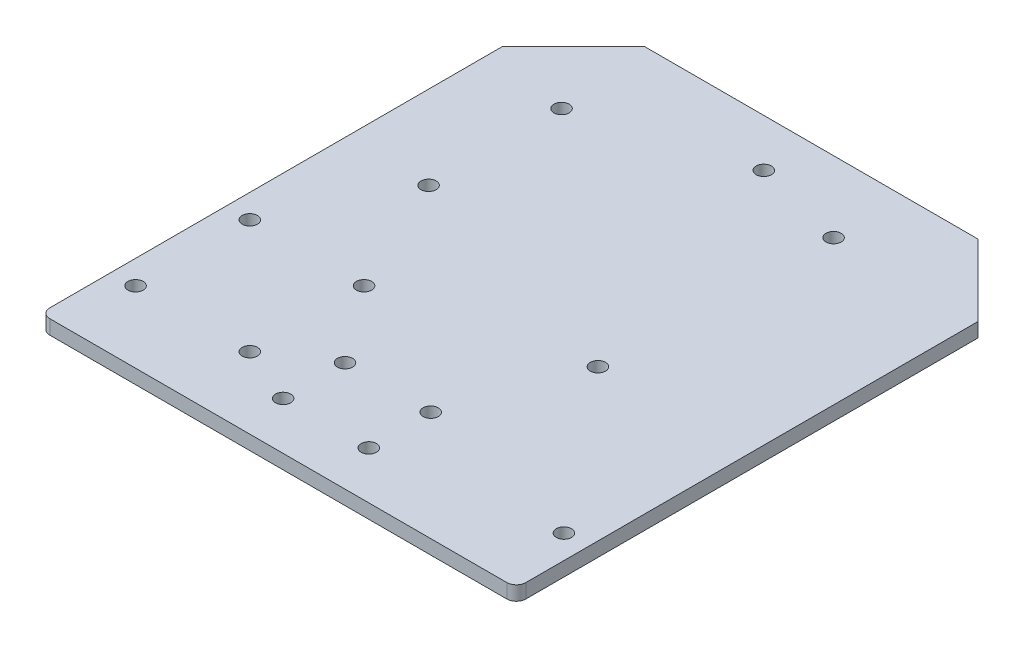
ISO-10303-21;
HEADER;
FILE_DESCRIPTION(('STEP AP214'),'2;1');
FILE_NAME('part.step','',(''),(''),'','','');
FILE_SCHEMA(('AUTOMOTIVE_DESIGN { 1 0 10303 214 1 1 1 1 }'));
ENDSEC;
DATA;
#1=APPLICATION_CONTEXT('core data for automotive mechanical design processes');
#2=APPLICATION_PROTOCOL_DEFINITION('international standard','automotive_design',2000,#1);
#3=PRODUCT_CONTEXT('',#1,'mechanical');
#4=PRODUCT('Part','Part','',(#3));
#5=PRODUCT_RELATED_PRODUCT_CATEGORY('part','',(#4));
#6=PRODUCT_DEFINITION_FORMATION('','',#4);
#7=PRODUCT_DEFINITION_CONTEXT('part definition',#1,'design');
#8=PRODUCT_DEFINITION('design','',#6,#7);
#9=PRODUCT_DEFINITION_SHAPE('','',#8);
#10=(LENGTH_UNIT() NAMED_UNIT(*) SI_UNIT(.MILLI.,.METRE.));
#11=(NAMED_UNIT(*) PLANE_ANGLE_UNIT() SI_UNIT($,.RADIAN.));
#12=(NAMED_UNIT(*) SI_UNIT($,.STERADIAN.) SOLID_ANGLE_UNIT());
#13=UNCERTAINTY_MEASURE_WITH_UNIT(LENGTH_MEASURE(1.E-05),#10,'distance_accuracy_value','');
#14=(GEOMETRIC_REPRESENTATION_CONTEXT(3) GLOBAL_UNCERTAINTY_ASSIGNED_CONTEXT((#13)) GLOBAL_UNIT_ASSIGNED_CONTEXT((#10,
#11,#12)) REPRESENTATION_CONTEXT('',''));
#15=CARTESIAN_POINT('',(0.,0.,0.));
#16=DIRECTION('',(0.,0.,1.));
#17=DIRECTION('',(1.,0.,0.));
#18=AXIS2_PLACEMENT_3D('',#15,#16,#17);
#19=CARTESIAN_POINT('',(7.5,0.,-104.5));
#20=DIRECTION('',(-0.707106781186548,0.,-0.707106781186548));
#21=DIRECTION('',(-0.707106781186548,0.,0.707106781186548));
#22=AXIS2_PLACEMENT_3D('',#19,#20,#21);
#23=PLANE('',#22);
#24=DIRECTION('',(0.707106781186548,0.,-0.707106781186548));
#25=VECTOR('',#24,1.);
#26=CARTESIAN_POINT('',(6.,3.,-103.));
#27=LINE('',#26,#25);
#28=CARTESIAN_POINT('',(0.,3.,-97.));
#29=VERTEX_POINT('',#28);
#30=CARTESIAN_POINT('',(15.,3.,-112.));
#31=VERTEX_POINT('',#30);
#32=EDGE_CURVE('E11',#29,#31,#27,.T.);
#33=ORIENTED_EDGE('',*,*,#32,.T.);
#34=DIRECTION('',(0.,-1.,0.));
#35=VECTOR('',#34,1.);
#36=CARTESIAN_POINT('',(15.,0.,-112.));
#37=LINE('',#36,#35);
#38=CARTESIAN_POINT('',(15.,0.,-112.));
#39=VERTEX_POINT('',#38);
#40=EDGE_CURVE('E57',#31,#39,#37,.T.);
#41=ORIENTED_EDGE('',*,*,#40,.T.);
#42=DIRECTION('',(-0.707106781186548,0.,0.707106781186548));
#43=VECTOR('',#42,1.);
#44=CARTESIAN_POINT('',(6.,0.,-103.));
#45=LINE('',#44,#43);
#46=CARTESIAN_POINT('',(0.,0.,-97.));
#47=VERTEX_POINT('',#46);
#48=EDGE_CURVE('E255',#39,#47,#45,.T.);
#49=ORIENTED_EDGE('',*,*,#48,.T.);
#50=DIRECTION('',(0.,1.,0.));
#51=VECTOR('',#50,1.);
#52=CARTESIAN_POINT('',(0.,0.,-97.));
#53=LINE('',#52,#51);
#54=EDGE_CURVE('E252',#47,#29,#53,.T.);
#55=ORIENTED_EDGE('',*,*,#54,.T.);
#56=EDGE_LOOP('',(#33,#41,#49,#55));
#57=FACE_BOUND('',#56,.T.);
#58=ADVANCED_FACE('F46',(#57),#23,.T.);
#59=CARTESIAN_POINT('',(0.,0.,-112.));
#60=DIRECTION('',(-1.,0.,0.));
#61=DIRECTION('',(0.,0.,1.));
#62=AXIS2_PLACEMENT_3D('',#59,#60,#61);
#63=PLANE('',#62);
#64=ORIENTED_EDGE('',*,*,#54,.F.);
#65=DIRECTION('',(0.,0.,1.));
#66=VECTOR('',#65,1.);
#67=CARTESIAN_POINT('',(0.,0.,-112.));
#68=LINE('',#67,#66);
#69=CARTESIAN_POINT('',(0.,0.,-2.));
#70=VERTEX_POINT('',#69);
#71=EDGE_CURVE('E256',#47,#70,#68,.T.);
#72=ORIENTED_EDGE('',*,*,#71,.T.);
#73=DIRECTION('',(0.,-1.,0.));
#74=VECTOR('',#73,1.);
#75=CARTESIAN_POINT('',(0.,0.,-2.));
#76=LINE('',#75,#74);
#77=CARTESIAN_POINT('',(0.,3.,-2.));
#78=VERTEX_POINT('',#77);
#79=EDGE_CURVE('E239',#78,#70,#76,.T.);
#80=ORIENTED_EDGE('',*,*,#79,.F.);
#81=DIRECTION('',(0.,0.,1.));
#82=VECTOR('',#81,1.);
#83=CARTESIAN_POINT('',(0.,3.,-112.));
#84=LINE('',#83,#82);
#85=EDGE_CURVE('E320',#29,#78,#84,.T.);
#86=ORIENTED_EDGE('',*,*,#85,.F.);
#87=EDGE_LOOP('',(#64,#72,#80,#86));
#88=FACE_BOUND('',#87,.T.);
#89=ADVANCED_FACE('F387',(#88),#63,.T.);
#90=CARTESIAN_POINT('',(50.,0.,-56.));
#91=DIRECTION('',(0.,1.,0.));
#92=DIRECTION('',(1.,0.,0.));
#93=AXIS2_PLACEMENT_3D('',#90,#91,#92);
#94=PLANE('',#93);
#95=CARTESIAN_POINT('',(5.,0.,-39.));
#96=DIRECTION('',(0.,1.,0.));
#97=DIRECTION('',(0.,0.,1.));
#98=AXIS2_PLACEMENT_3D('',#95,#96,#97);
#99=CIRCLE('',#98,1.6);
#100=CARTESIAN_POINT('',(5.,0.,-37.4));
#101=VERTEX_POINT('',#100);
#102=EDGE_CURVE('E435',#101,#101,#99,.T.);
#103=ORIENTED_EDGE('',*,*,#102,.T.);
#104=EDGE_LOOP('',(#103));
#105=FACE_BOUND('',#104,.T.);
#106=CARTESIAN_POINT('',(29.,0.,-39.));
#107=DIRECTION('',(0.,1.,0.));
#108=DIRECTION('',(0.,0.,1.));
#109=AXIS2_PLACEMENT_3D('',#106,#107,#108);
#110=CIRCLE('',#109,1.60000000000001);
#111=CARTESIAN_POINT('',(29.,0.,-37.4));
#112=VERTEX_POINT('',#111);
#113=EDGE_CURVE('E440',#112,#112,#110,.T.);
#114=ORIENTED_EDGE('',*,*,#113,.T.);
#115=EDGE_LOOP('',(#114));
#116=FACE_BOUND('',#115,.T.);
#117=CARTESIAN_POINT('',(29.,0.,-15.));
#118=DIRECTION('',(0.,1.,0.));
#119=DIRECTION('',(0.,0.,1.));
#120=AXIS2_PLACEMENT_3D('',#117,#118,#119);
#121=CIRCLE('',#120,1.60000000000001);
#122=CARTESIAN_POINT('',(29.,0.,-13.4));
#123=VERTEX_POINT('',#122);
#124=EDGE_CURVE('E445',#123,#123,#121,.T.);
#125=ORIENTED_EDGE('',*,*,#124,.T.);
#126=EDGE_LOOP('',(#125));
#127=FACE_BOUND('',#126,.T.);
#128=ORIENTED_EDGE('',*,*,#48,.F.);
#129=DIRECTION('',(-1.,0.,0.));
#130=VECTOR('',#129,1.);
#131=CARTESIAN_POINT('',(100.,0.,-112.));
#132=LINE('',#131,#130);
#133=CARTESIAN_POINT('',(85.,0.,-112.));
#134=VERTEX_POINT('',#133);
#135=EDGE_CURVE('E233',#134,#39,#132,.T.);
#136=ORIENTED_EDGE('',*,*,#135,.F.);
#137=DIRECTION('',(-0.707106781186548,0.,-0.707106781186548));
#138=VECTOR('',#137,1.);
#139=CARTESIAN_POINT('',(94.,0.,-103.));
#140=LINE('',#139,#138);
#141=CARTESIAN_POINT('',(100.,0.,-97.));
#142=VERTEX_POINT('',#141);
#143=EDGE_CURVE('E323',#142,#134,#140,.T.);
#144=ORIENTED_EDGE('',*,*,#143,.F.);
#145=DIRECTION('',(0.,0.,-1.));
#146=VECTOR('',#145,1.);
#147=CARTESIAN_POINT('',(100.,0.,0.));
#148=LINE('',#147,#146);
#149=CARTESIAN_POINT('',(100.,0.,-2.));
#150=VERTEX_POINT('',#149);
#151=EDGE_CURVE('E358',#150,#142,#148,.T.);
#152=ORIENTED_EDGE('',*,*,#151,.F.);
#153=CARTESIAN_POINT('',(98.,0.,-2.));
#154=DIRECTION('',(0.,1.,0.));
#155=DIRECTION('',(0.707106781186546,0.,0.707106781186549));
#156=AXIS2_PLACEMENT_3D('',#153,#154,#155);
#157=CIRCLE('',#156,2.);
#158=CARTESIAN_POINT('',(98.,0.,0.));
#159=VERTEX_POINT('',#158);
#160=EDGE_CURVE('E293',#159,#150,#157,.T.);
#161=ORIENTED_EDGE('',*,*,#160,.F.);
#162=DIRECTION('',(1.,0.,0.));
#163=VECTOR('',#162,1.);
#164=CARTESIAN_POINT('',(0.,0.,0.));
#165=LINE('',#164,#163);
#166=CARTESIAN_POINT('',(2.,0.,0.));
#167=VERTEX_POINT('',#166);
#168=EDGE_CURVE('E230',#167,#159,#165,.T.);
#169=ORIENTED_EDGE('',*,*,#168,.F.);
#170=CARTESIAN_POINT('',(2.,0.,-2.));
#171=DIRECTION('',(0.,1.,0.));
#172=DIRECTION('',(-0.707106781186547,0.,0.707106781186548));
#173=AXIS2_PLACEMENT_3D('',#170,#171,#172);
#174=CIRCLE('',#173,2.);
#175=EDGE_CURVE('E304',#70,#167,#174,.T.);
#176=ORIENTED_EDGE('',*,*,#175,.F.);
#177=ORIENTED_EDGE('',*,*,#71,.F.);
#178=EDGE_LOOP('',(#128,#136,#144,#152,#161,#169,#176,#177));
#179=FACE_BOUND('',#178,.T.);
#180=CARTESIAN_POINT('',(69.57,0.,-97.08));
#181=DIRECTION('',(0.,-1.,0.));
#182=DIRECTION('',(1.,0.,0.));
#183=AXIS2_PLACEMENT_3D('',#180,#181,#182);
#184=CIRCLE('',#183,1.6);
#185=CARTESIAN_POINT('',(67.97,0.,-97.08));
#186=VERTEX_POINT('',#185);
#187=EDGE_CURVE('E225',#186,#186,#184,.T.);
#188=ORIENTED_EDGE('',*,*,#187,.F.);
#189=EDGE_LOOP('',(#188));
#190=FACE_BOUND('',#189,.T.);
#191=CARTESIAN_POINT('',(17.5,0.,-92.));
#192=DIRECTION('',(0.,-1.,0.));
#193=DIRECTION('',(1.,0.,0.));
#194=AXIS2_PLACEMENT_3D('',#191,#192,#193);
#195=CIRCLE('',#194,1.6);
#196=CARTESIAN_POINT('',(15.9,0.,-92.));
#197=VERTEX_POINT('',#196);
#198=EDGE_CURVE('E210',#197,#197,#195,.T.);
#199=ORIENTED_EDGE('',*,*,#198,.F.);
#200=EDGE_LOOP('',(#199));
#201=FACE_BOUND('',#200,.T.);
#202=CARTESIAN_POINT('',(50.,0.,-102.));
#203=DIRECTION('',(0.,-1.,0.));
#204=DIRECTION('',(1.,0.,0.));
#205=AXIS2_PLACEMENT_3D('',#202,#203,#204);
#206=CIRCLE('',#205,1.6);
#207=CARTESIAN_POINT('',(48.4,0.,-102.));
#208=VERTEX_POINT('',#207);
#209=EDGE_CURVE('E222',#208,#208,#206,.T.);
#210=ORIENTED_EDGE('',*,*,#209,.F.);
#211=EDGE_LOOP('',(#210));
#212=FACE_BOUND('',#211,.T.);
#213=CARTESIAN_POINT('',(68.3,0.,-48.837));
#214=DIRECTION('',(0.,-1.,0.));
#215=DIRECTION('',(1.,0.,0.));
#216=AXIS2_PLACEMENT_3D('',#213,#214,#215);
#217=CIRCLE('',#216,1.6);
#218=CARTESIAN_POINT('',(66.7,0.,-48.837));
#219=VERTEX_POINT('',#218);
#220=EDGE_CURVE('E299',#219,#219,#217,.T.);
#221=ORIENTED_EDGE('',*,*,#220,.F.);
#222=EDGE_LOOP('',(#221));
#223=FACE_BOUND('',#222,.T.);
#224=CARTESIAN_POINT('',(17.5,0.,-64.06));
#225=DIRECTION('',(0.,-1.,0.));
#226=DIRECTION('',(1.,0.,0.));
#227=AXIS2_PLACEMENT_3D('',#224,#225,#226);
#228=CIRCLE('',#227,1.6);
#229=CARTESIAN_POINT('',(15.9,0.,-64.06));
#230=VERTEX_POINT('',#229);
#231=EDGE_CURVE('E257',#230,#230,#228,.T.);
#232=ORIENTED_EDGE('',*,*,#231,.F.);
#233=EDGE_LOOP('',(#232));
#234=FACE_BOUND('',#233,.T.);
#235=CARTESIAN_POINT('',(59.,0.,-23.));
#236=DIRECTION('',(0.,-1.,0.));
#237=DIRECTION('',(1.,0.,0.));
#238=AXIS2_PLACEMENT_3D('',#235,#236,#237);
#239=CIRCLE('',#238,1.6);
#240=CARTESIAN_POINT('',(57.4,0.,-23.));
#241=VERTEX_POINT('',#240);
#242=EDGE_CURVE('E365',#241,#241,#239,.T.);
#243=ORIENTED_EDGE('',*,*,#242,.F.);
#244=EDGE_LOOP('',(#243));
#245=FACE_BOUND('',#244,.T.);
#246=CARTESIAN_POINT('',(41.,0.,-23.));
#247=DIRECTION('',(0.,-1.,0.));
#248=DIRECTION('',(1.,0.,0.));
#249=AXIS2_PLACEMENT_3D('',#246,#247,#248);
#250=CIRCLE('',#249,1.6);
#251=CARTESIAN_POINT('',(39.4,0.,-23.));
#252=VERTEX_POINT('',#251);
#253=EDGE_CURVE('E328',#252,#252,#250,.T.);
#254=ORIENTED_EDGE('',*,*,#253,.F.);
#255=EDGE_LOOP('',(#254));
#256=FACE_BOUND('',#255,.T.);
#257=CARTESIAN_POINT('',(59.,0.,-10.));
#258=DIRECTION('',(0.,-1.,0.));
#259=DIRECTION('',(1.,0.,0.));
#260=AXIS2_PLACEMENT_3D('',#257,#258,#259);
#261=CIRCLE('',#260,1.6);
#262=CARTESIAN_POINT('',(57.4,0.,-10.));
#263=VERTEX_POINT('',#262);
#264=EDGE_CURVE('E343',#263,#263,#261,.T.);
#265=ORIENTED_EDGE('',*,*,#264,.F.);
#266=EDGE_LOOP('',(#265));
#267=FACE_BOUND('',#266,.T.);
#268=CARTESIAN_POINT('',(41.,0.,-10.));
#269=DIRECTION('',(0.,-1.,0.));
#270=DIRECTION('',(1.,0.,0.));
#271=AXIS2_PLACEMENT_3D('',#268,#269,#270);
#272=CIRCLE('',#271,1.6);
#273=CARTESIAN_POINT('',(39.4,0.,-10.));
#274=VERTEX_POINT('',#273);
#275=EDGE_CURVE('E280',#274,#274,#272,.T.);
#276=ORIENTED_EDGE('',*,*,#275,.F.);
#277=EDGE_LOOP('',(#276));
#278=FACE_BOUND('',#277,.T.);
#279=CARTESIAN_POINT('',(5.,0.,-15.));
#280=DIRECTION('',(0.,-1.,0.));
#281=DIRECTION('',(1.,0.,0.));
#282=AXIS2_PLACEMENT_3D('',#279,#280,#281);
#283=CIRCLE('',#282,1.6);
#284=CARTESIAN_POINT('',(3.4,0.,-15.));
#285=VERTEX_POINT('',#284);
#286=EDGE_CURVE('E275',#285,#285,#283,.T.);
#287=ORIENTED_EDGE('',*,*,#286,.F.);
#288=EDGE_LOOP('',(#287));
#289=FACE_BOUND('',#288,.T.);
#290=CARTESIAN_POINT('',(95.,0.,-15.));
#291=DIRECTION('',(0.,-1.,0.));
#292=DIRECTION('',(1.,0.,0.));
#293=AXIS2_PLACEMENT_3D('',#290,#291,#292);
#294=CIRCLE('',#293,1.6);
#295=CARTESIAN_POINT('',(93.4,0.,-15.));
#296=VERTEX_POINT('',#295);
#297=EDGE_CURVE('E246',#296,#296,#294,.T.);
#298=ORIENTED_EDGE('',*,*,#297,.F.);
#299=EDGE_LOOP('',(#298));
#300=FACE_BOUND('',#299,.T.);
#301=ADVANCED_FACE('F211',(#105,#116,#127,#179,#190,#201,#212,#223,#234,#245,#256,#267,#278,
#289,#300),#94,.F.);
#302=CARTESIAN_POINT('',(92.5,0.,-104.5));
#303=DIRECTION('',(0.707106781186548,0.,-0.707106781186548));
#304=DIRECTION('',(0.,-1.,0.));
#305=AXIS2_PLACEMENT_3D('',#302,#303,#304);
#306=PLANE('',#305);
#307=DIRECTION('',(0.707106781186548,0.,0.707106781186548));
#308=VECTOR('',#307,1.);
#309=CARTESIAN_POINT('',(94.,3.,-103.));
#310=LINE('',#309,#308);
#311=CARTESIAN_POINT('',(85.,3.,-112.));
#312=VERTEX_POINT('',#311);
#313=CARTESIAN_POINT('',(100.,3.,-97.));
#314=VERTEX_POINT('',#313);
#315=EDGE_CURVE('E267',#312,#314,#310,.T.);
#316=ORIENTED_EDGE('',*,*,#315,.T.);
#317=DIRECTION('',(0.,-1.,0.));
#318=VECTOR('',#317,1.);
#319=CARTESIAN_POINT('',(100.,0.,-97.));
#320=LINE('',#319,#318);
#321=EDGE_CURVE('E271',#314,#142,#320,.T.);
#322=ORIENTED_EDGE('',*,*,#321,.T.);
#323=ORIENTED_EDGE('',*,*,#143,.T.);
#324=DIRECTION('',(0.,1.,0.));
#325=VECTOR('',#324,1.);
#326=CARTESIAN_POINT('',(85.,0.,-112.));
#327=LINE('',#326,#325);
#328=EDGE_CURVE('E327',#134,#312,#327,.T.);
#329=ORIENTED_EDGE('',*,*,#328,.T.);
#330=EDGE_LOOP('',(#316,#322,#323,#329));
#331=FACE_BOUND('',#330,.T.);
#332=ADVANCED_FACE('F386',(#331),#306,.T.);
#333=CARTESIAN_POINT('',(100.,0.,0.));
#334=DIRECTION('',(1.,0.,0.));
#335=DIRECTION('',(0.,1.,0.));
#336=AXIS2_PLACEMENT_3D('',#333,#334,#335);
#337=PLANE('',#336);
#338=ORIENTED_EDGE('',*,*,#321,.F.);
#339=DIRECTION('',(0.,0.,-1.));
#340=VECTOR('',#339,1.);
#341=CARTESIAN_POINT('',(100.,3.,0.));
#342=LINE('',#341,#340);
#343=CARTESIAN_POINT('',(100.,3.,-2.));
#344=VERTEX_POINT('',#343);
#345=EDGE_CURVE('E174',#344,#314,#342,.T.);
#346=ORIENTED_EDGE('',*,*,#345,.F.);
#347=DIRECTION('',(0.,1.,0.));
#348=VECTOR('',#347,1.);
#349=CARTESIAN_POINT('',(100.,0.,-2.));
#350=LINE('',#349,#348);
#351=EDGE_CURVE('E238',#150,#344,#350,.T.);
#352=ORIENTED_EDGE('',*,*,#351,.F.);
#353=ORIENTED_EDGE('',*,*,#151,.T.);
#354=EDGE_LOOP('',(#338,#346,#352,#353));
#355=FACE_BOUND('',#354,.T.);
#356=ADVANCED_FACE('F766',(#355),#337,.T.);
#357=CARTESIAN_POINT('',(98.,0.,-2.));
#358=DIRECTION('',(0.,1.,0.));
#359=DIRECTION('',(0.707106781186546,0.,0.707106781186549));
#360=AXIS2_PLACEMENT_3D('',#357,#358,#359);
#361=CYLINDRICAL_SURFACE('',#360,2.);
#362=CARTESIAN_POINT('',(98.,3.,-2.));
#363=DIRECTION('',(0.,-1.,0.));
#364=DIRECTION('',(0.707106781186546,0.,0.707106781186549));
#365=AXIS2_PLACEMENT_3D('',#362,#363,#364);
#366=CIRCLE('',#365,2.);
#367=CARTESIAN_POINT('',(98.,3.,0.));
#368=VERTEX_POINT('',#367);
#369=EDGE_CURVE('E228',#344,#368,#366,.T.);
#370=ORIENTED_EDGE('',*,*,#369,.T.);
#371=DIRECTION('',(0.,-1.,0.));
#372=VECTOR('',#371,1.);
#373=CARTESIAN_POINT('',(98.,0.,0.));
#374=LINE('',#373,#372);
#375=EDGE_CURVE('E189',#368,#159,#374,.T.);
#376=ORIENTED_EDGE('',*,*,#375,.T.);
#377=ORIENTED_EDGE('',*,*,#160,.T.);
#378=ORIENTED_EDGE('',*,*,#351,.T.);
#379=EDGE_LOOP('',(#370,#376,#377,#378));
#380=FACE_BOUND('',#379,.T.);
#381=ADVANCED_FACE('F458',(#380),#361,.T.);
#382=CARTESIAN_POINT('',(2.,0.,-2.));
#383=DIRECTION('',(0.,1.,0.));
#384=DIRECTION('',(-0.707106781186547,0.,0.707106781186548));
#385=AXIS2_PLACEMENT_3D('',#382,#383,#384);
#386=CYLINDRICAL_SURFACE('',#385,2.);
#387=CARTESIAN_POINT('',(2.,3.,-2.));
#388=DIRECTION('',(0.,-1.,0.));
#389=DIRECTION('',(-0.707106781186547,0.,0.707106781186548));
#390=AXIS2_PLACEMENT_3D('',#387,#388,#389);
#391=CIRCLE('',#390,2.);
#392=CARTESIAN_POINT('',(2.,3.,0.));
#393=VERTEX_POINT('',#392);
#394=EDGE_CURVE('E234',#393,#78,#391,.T.);
#395=ORIENTED_EDGE('',*,*,#394,.T.);
#396=ORIENTED_EDGE('',*,*,#79,.T.);
#397=ORIENTED_EDGE('',*,*,#175,.T.);
#398=DIRECTION('',(0.,1.,0.));
#399=VECTOR('',#398,1.);
#400=CARTESIAN_POINT('',(2.,0.,0.));
#401=LINE('',#400,#399);
#402=EDGE_CURVE('E308',#167,#393,#401,.T.);
#403=ORIENTED_EDGE('',*,*,#402,.T.);
#404=EDGE_LOOP('',(#395,#396,#397,#403));
#405=FACE_BOUND('',#404,.T.);
#406=ADVANCED_FACE('F702',(#405),#386,.T.);
#407=CARTESIAN_POINT('',(95.,0.,-15.));
#408=DIRECTION('',(0.,1.,0.));
#409=DIRECTION('',(1.,0.,0.));
#410=AXIS2_PLACEMENT_3D('',#407,#408,#409);
#411=CYLINDRICAL_SURFACE('',#410,1.6);
#412=CARTESIAN_POINT('',(95.,3.,-15.));
#413=DIRECTION('',(0.,-1.,0.));
#414=DIRECTION('',(1.,0.,0.));
#415=AXIS2_PLACEMENT_3D('',#412,#413,#414);
#416=CIRCLE('',#415,1.6);
#417=CARTESIAN_POINT('',(93.4,3.,-15.));
#418=VERTEX_POINT('',#417);
#419=EDGE_CURVE('E286',#418,#418,#416,.T.);
#420=ORIENTED_EDGE('',*,*,#419,.F.);
#421=DIRECTION('',(0.,-1.,0.));
#422=VECTOR('',#421,1.);
#423=CARTESIAN_POINT('',(93.4,0.,-15.));
#424=LINE('',#423,#422);
#425=EDGE_CURVE('E250',#418,#296,#424,.T.);
#426=ORIENTED_EDGE('',*,*,#425,.T.);
#427=ORIENTED_EDGE('',*,*,#297,.T.);
#428=ORIENTED_EDGE('',*,*,#425,.F.);
#429=EDGE_LOOP('',(#420,#426,#427,#428));
#430=FACE_BOUND('',#429,.T.);
#431=ADVANCED_FACE('F404',(#430),#411,.F.);
#432=CARTESIAN_POINT('',(5.,0.,-15.));
#433=DIRECTION('',(0.,1.,0.));
#434=DIRECTION('',(1.,0.,0.));
#435=AXIS2_PLACEMENT_3D('',#432,#433,#434);
#436=CYLINDRICAL_SURFACE('',#435,1.6);
#437=CARTESIAN_POINT('',(5.,3.,-15.));
#438=DIRECTION('',(0.,-1.,0.));
#439=DIRECTION('',(1.,0.,0.));
#440=AXIS2_PLACEMENT_3D('',#437,#438,#439);
#441=CIRCLE('',#440,1.6);
#442=CARTESIAN_POINT('',(3.4,3.,-15.));
#443=VERTEX_POINT('',#442);
#444=EDGE_CURVE('E281',#443,#443,#441,.T.);
#445=ORIENTED_EDGE('',*,*,#444,.F.);
#446=DIRECTION('',(0.,-1.,0.));
#447=VECTOR('',#446,1.);
#448=CARTESIAN_POINT('',(3.4,0.,-15.));
#449=LINE('',#448,#447);
#450=EDGE_CURVE('E251',#443,#285,#449,.T.);
#451=ORIENTED_EDGE('',*,*,#450,.T.);
#452=ORIENTED_EDGE('',*,*,#286,.T.);
#453=ORIENTED_EDGE('',*,*,#450,.F.);
#454=EDGE_LOOP('',(#445,#451,#452,#453));
#455=FACE_BOUND('',#454,.T.);
#456=ADVANCED_FACE('F713',(#455),#436,.F.);
#457=CARTESIAN_POINT('',(41.,0.,-10.));
#458=DIRECTION('',(0.,1.,0.));
#459=DIRECTION('',(1.,0.,0.));
#460=AXIS2_PLACEMENT_3D('',#457,#458,#459);
#461=CYLINDRICAL_SURFACE('',#460,1.6);
#462=CARTESIAN_POINT('',(41.,3.,-10.));
#463=DIRECTION('',(0.,-1.,0.));
#464=DIRECTION('',(1.,0.,0.));
#465=AXIS2_PLACEMENT_3D('',#462,#463,#464);
#466=CIRCLE('',#465,1.6);
#467=CARTESIAN_POINT('',(39.4,3.,-10.));
#468=VERTEX_POINT('',#467);
#469=EDGE_CURVE('E285',#468,#468,#466,.T.);
#470=ORIENTED_EDGE('',*,*,#469,.F.);
#471=DIRECTION('',(0.,-1.,0.));
#472=VECTOR('',#471,1.);
#473=CARTESIAN_POINT('',(39.4,0.,-10.));
#474=LINE('',#473,#472);
#475=EDGE_CURVE('E276',#468,#274,#474,.T.);
#476=ORIENTED_EDGE('',*,*,#475,.T.);
#477=ORIENTED_EDGE('',*,*,#275,.T.);
#478=ORIENTED_EDGE('',*,*,#475,.F.);
#479=EDGE_LOOP('',(#470,#476,#477,#478));
#480=FACE_BOUND('',#479,.T.);
#481=ADVANCED_FACE('F721',(#480),#461,.F.);
#482=CARTESIAN_POINT('',(59.,0.,-10.));
#483=DIRECTION('',(0.,1.,0.));
#484=DIRECTION('',(1.,0.,0.));
#485=AXIS2_PLACEMENT_3D('',#482,#483,#484);
#486=CYLINDRICAL_SURFACE('',#485,1.6);
#487=CARTESIAN_POINT('',(59.,3.,-10.));
#488=DIRECTION('',(0.,-1.,0.));
#489=DIRECTION('',(1.,0.,0.));
#490=AXIS2_PLACEMENT_3D('',#487,#488,#489);
#491=CIRCLE('',#490,1.6);
#492=CARTESIAN_POINT('',(57.4,3.,-10.));
#493=VERTEX_POINT('',#492);
#494=EDGE_CURVE('E292',#493,#493,#491,.T.);
#495=ORIENTED_EDGE('',*,*,#494,.F.);
#496=DIRECTION('',(0.,-1.,0.));
#497=VECTOR('',#496,1.);
#498=CARTESIAN_POINT('',(57.4,0.,-10.));
#499=LINE('',#498,#497);
#500=EDGE_CURVE('E347',#493,#263,#499,.T.);
#501=ORIENTED_EDGE('',*,*,#500,.T.);
#502=ORIENTED_EDGE('',*,*,#264,.T.);
#503=ORIENTED_EDGE('',*,*,#500,.F.);
#504=EDGE_LOOP('',(#495,#501,#502,#503));
#505=FACE_BOUND('',#504,.T.);
#506=ADVANCED_FACE('F741',(#505),#486,.F.);
#507=CARTESIAN_POINT('',(41.,0.,-23.));
#508=DIRECTION('',(0.,1.,0.));
#509=DIRECTION('',(1.,0.,0.));
#510=AXIS2_PLACEMENT_3D('',#507,#508,#509);
#511=CYLINDRICAL_SURFACE('',#510,1.6);
#512=CARTESIAN_POINT('',(41.,3.,-23.));
#513=DIRECTION('',(0.,-1.,0.));
#514=DIRECTION('',(1.,0.,0.));
#515=AXIS2_PLACEMENT_3D('',#512,#513,#514);
#516=CIRCLE('',#515,1.6);
#517=CARTESIAN_POINT('',(39.4,3.,-23.));
#518=VERTEX_POINT('',#517);
#519=EDGE_CURVE('E287',#518,#518,#516,.T.);
#520=ORIENTED_EDGE('',*,*,#519,.F.);
#521=DIRECTION('',(0.,-1.,0.));
#522=VECTOR('',#521,1.);
#523=CARTESIAN_POINT('',(39.4,0.,-23.));
#524=LINE('',#523,#522);
#525=EDGE_CURVE('E332',#518,#252,#524,.T.);
#526=ORIENTED_EDGE('',*,*,#525,.T.);
#527=ORIENTED_EDGE('',*,*,#253,.T.);
#528=ORIENTED_EDGE('',*,*,#525,.F.);
#529=EDGE_LOOP('',(#520,#526,#527,#528));
#530=FACE_BOUND('',#529,.T.);
#531=ADVANCED_FACE('F732',(#530),#511,.F.);
#532=CARTESIAN_POINT('',(59.,0.,-23.));
#533=DIRECTION('',(0.,1.,0.));
#534=DIRECTION('',(1.,0.,0.));
#535=AXIS2_PLACEMENT_3D('',#532,#533,#534);
#536=CYLINDRICAL_SURFACE('',#535,1.6);
#537=CARTESIAN_POINT('',(59.,3.,-23.));
#538=DIRECTION('',(0.,-1.,0.));
#539=DIRECTION('',(1.,0.,0.));
#540=AXIS2_PLACEMENT_3D('',#537,#538,#539);
#541=CIRCLE('',#540,1.6);
#542=CARTESIAN_POINT('',(57.4,3.,-23.));
#543=VERTEX_POINT('',#542);
#544=EDGE_CURVE('E291',#543,#543,#541,.T.);
#545=ORIENTED_EDGE('',*,*,#544,.F.);
#546=DIRECTION('',(0.,-1.,0.));
#547=VECTOR('',#546,1.);
#548=CARTESIAN_POINT('',(57.4,0.,-23.));
#549=LINE('',#548,#547);
#550=EDGE_CURVE('E333',#543,#241,#549,.T.);
#551=ORIENTED_EDGE('',*,*,#550,.T.);
#552=ORIENTED_EDGE('',*,*,#242,.T.);
#553=ORIENTED_EDGE('',*,*,#550,.F.);
#554=EDGE_LOOP('',(#545,#551,#552,#553));
#555=FACE_BOUND('',#554,.T.);
#556=ADVANCED_FACE('F727',(#555),#536,.F.);
#557=CARTESIAN_POINT('',(17.5,0.,-64.06));
#558=DIRECTION('',(0.,1.,0.));
#559=DIRECTION('',(1.,0.,0.));
#560=AXIS2_PLACEMENT_3D('',#557,#558,#559);
#561=CYLINDRICAL_SURFACE('',#560,1.6);
#562=CARTESIAN_POINT('',(17.5,3.,-64.06));
#563=DIRECTION('',(0.,-1.,0.));
#564=DIRECTION('',(1.,0.,0.));
#565=AXIS2_PLACEMENT_3D('',#562,#563,#564);
#566=CIRCLE('',#565,1.6);
#567=CARTESIAN_POINT('',(15.9,3.,-64.06));
#568=VERTEX_POINT('',#567);
#569=EDGE_CURVE('E319',#568,#568,#566,.T.);
#570=ORIENTED_EDGE('',*,*,#569,.F.);
#571=DIRECTION('',(0.,-1.,0.));
#572=VECTOR('',#571,1.);
#573=CARTESIAN_POINT('',(15.9,0.,-64.06));
#574=LINE('',#573,#572);
#575=EDGE_CURVE('E261',#568,#230,#574,.T.);
#576=ORIENTED_EDGE('',*,*,#575,.T.);
#577=ORIENTED_EDGE('',*,*,#231,.T.);
#578=ORIENTED_EDGE('',*,*,#575,.F.);
#579=EDGE_LOOP('',(#570,#576,#577,#578));
#580=FACE_BOUND('',#579,.T.);
#581=ADVANCED_FACE('F731',(#580),#561,.F.);
#582=CARTESIAN_POINT('',(68.3,0.,-48.837));
#583=DIRECTION('',(0.,1.,0.));
#584=DIRECTION('',(1.,0.,0.));
#585=AXIS2_PLACEMENT_3D('',#582,#583,#584);
#586=CYLINDRICAL_SURFACE('',#585,1.6);
#587=CARTESIAN_POINT('',(68.3,3.,-48.837));
#588=DIRECTION('',(0.,-1.,0.));
#589=DIRECTION('',(1.,0.,0.));
#590=AXIS2_PLACEMENT_3D('',#587,#588,#589);
#591=CIRCLE('',#590,1.6);
#592=CARTESIAN_POINT('',(66.7,3.,-48.837));
#593=VERTEX_POINT('',#592);
#594=EDGE_CURVE('E315',#593,#593,#591,.T.);
#595=ORIENTED_EDGE('',*,*,#594,.F.);
#596=DIRECTION('',(0.,-1.,0.));
#597=VECTOR('',#596,1.);
#598=CARTESIAN_POINT('',(66.7,0.,-48.837));
#599=LINE('',#598,#597);
#600=EDGE_CURVE('E262',#593,#219,#599,.T.);
#601=ORIENTED_EDGE('',*,*,#600,.T.);
#602=ORIENTED_EDGE('',*,*,#220,.T.);
#603=ORIENTED_EDGE('',*,*,#600,.F.);
#604=EDGE_LOOP('',(#595,#601,#602,#603));
#605=FACE_BOUND('',#604,.T.);
#606=ADVANCED_FACE('F775',(#605),#586,.F.);
#607=CARTESIAN_POINT('',(50.,0.,-102.));
#608=DIRECTION('',(0.,1.,0.));
#609=DIRECTION('',(1.,0.,0.));
#610=AXIS2_PLACEMENT_3D('',#607,#608,#609);
#611=CYLINDRICAL_SURFACE('',#610,1.6);
#612=CARTESIAN_POINT('',(50.,3.,-102.));
#613=DIRECTION('',(0.,-1.,0.));
#614=DIRECTION('',(1.,0.,0.));
#615=AXIS2_PLACEMENT_3D('',#612,#613,#614);
#616=CIRCLE('',#615,1.6);
#617=CARTESIAN_POINT('',(48.4,3.,-102.));
#618=VERTEX_POINT('',#617);
#619=EDGE_CURVE('E245',#618,#618,#616,.T.);
#620=ORIENTED_EDGE('',*,*,#619,.F.);
#621=DIRECTION('',(0.,-1.,0.));
#622=VECTOR('',#621,1.);
#623=CARTESIAN_POINT('',(48.4,0.,-102.));
#624=LINE('',#623,#622);
#625=EDGE_CURVE('E303',#618,#208,#624,.T.);
#626=ORIENTED_EDGE('',*,*,#625,.T.);
#627=ORIENTED_EDGE('',*,*,#209,.T.);
#628=ORIENTED_EDGE('',*,*,#625,.F.);
#629=EDGE_LOOP('',(#620,#626,#627,#628));
#630=FACE_BOUND('',#629,.T.);
#631=ADVANCED_FACE('F383',(#630),#611,.F.);
#632=CARTESIAN_POINT('',(17.5,0.,-92.));
#633=DIRECTION('',(0.,1.,0.));
#634=DIRECTION('',(1.,0.,0.));
#635=AXIS2_PLACEMENT_3D('',#632,#633,#634);
#636=CYLINDRICAL_SURFACE('',#635,1.6);
#637=CARTESIAN_POINT('',(17.5,3.,-92.));
#638=DIRECTION('',(0.,-1.,0.));
#639=DIRECTION('',(1.,0.,0.));
#640=AXIS2_PLACEMENT_3D('',#637,#638,#639);
#641=CIRCLE('',#640,1.6);
#642=CARTESIAN_POINT('',(15.9,3.,-92.));
#643=VERTEX_POINT('',#642);
#644=EDGE_CURVE('E240',#643,#643,#641,.T.);
#645=ORIENTED_EDGE('',*,*,#644,.F.);
#646=DIRECTION('',(0.,-1.,0.));
#647=VECTOR('',#646,1.);
#648=CARTESIAN_POINT('',(15.9,0.,-92.));
#649=LINE('',#648,#647);
#650=EDGE_CURVE('E217',#643,#197,#649,.T.);
#651=ORIENTED_EDGE('',*,*,#650,.T.);
#652=ORIENTED_EDGE('',*,*,#198,.T.);
#653=ORIENTED_EDGE('',*,*,#650,.F.);
#654=EDGE_LOOP('',(#645,#651,#652,#653));
#655=FACE_BOUND('',#654,.T.);
#656=ADVANCED_FACE('F755',(#655),#636,.F.);
#657=CARTESIAN_POINT('',(69.57,0.,-97.08));
#658=DIRECTION('',(0.,1.,0.));
#659=DIRECTION('',(1.,0.,0.));
#660=AXIS2_PLACEMENT_3D('',#657,#658,#659);
#661=CYLINDRICAL_SURFACE('',#660,1.6);
#662=CARTESIAN_POINT('',(69.57,3.,-97.08));
#663=DIRECTION('',(0.,-1.,0.));
#664=DIRECTION('',(1.,0.,0.));
#665=AXIS2_PLACEMENT_3D('',#662,#663,#664);
#666=CIRCLE('',#665,1.6);
#667=CARTESIAN_POINT('',(67.97,3.,-97.08));
#668=VERTEX_POINT('',#667);
#669=EDGE_CURVE('E244',#668,#668,#666,.T.);
#670=ORIENTED_EDGE('',*,*,#669,.F.);
#671=DIRECTION('',(0.,-1.,0.));
#672=VECTOR('',#671,1.);
#673=CARTESIAN_POINT('',(67.97,0.,-97.08));
#674=LINE('',#673,#672);
#675=EDGE_CURVE('E50',#668,#186,#674,.T.);
#676=ORIENTED_EDGE('',*,*,#675,.T.);
#677=ORIENTED_EDGE('',*,*,#187,.T.);
#678=ORIENTED_EDGE('',*,*,#675,.F.);
#679=EDGE_LOOP('',(#670,#676,#677,#678));
#680=FACE_BOUND('',#679,.T.);
#681=ADVANCED_FACE('F698',(#680),#661,.F.);
#682=CARTESIAN_POINT('',(0.,0.,0.));
#683=DIRECTION('',(0.,0.,1.));
#684=DIRECTION('',(1.,0.,0.));
#685=AXIS2_PLACEMENT_3D('',#682,#683,#684);
#686=PLANE('',#685);
#687=ORIENTED_EDGE('',*,*,#375,.F.);
#688=DIRECTION('',(1.,0.,0.));
#689=VECTOR('',#688,1.);
#690=CARTESIAN_POINT('',(0.,3.,0.));
#691=LINE('',#690,#689);
#692=EDGE_CURVE('E265',#393,#368,#691,.T.);
#693=ORIENTED_EDGE('',*,*,#692,.F.);
#694=ORIENTED_EDGE('',*,*,#402,.F.);
#695=ORIENTED_EDGE('',*,*,#168,.T.);
#696=EDGE_LOOP('',(#687,#693,#694,#695));
#697=FACE_BOUND('',#696,.T.);
#698=ADVANCED_FACE('F48',(#697),#686,.T.);
#699=CARTESIAN_POINT('',(100.,0.,-112.));
#700=DIRECTION('',(0.,0.,-1.));
#701=DIRECTION('',(0.,-1.,0.));
#702=AXIS2_PLACEMENT_3D('',#699,#700,#701);
#703=PLANE('',#702);
#704=ORIENTED_EDGE('',*,*,#40,.F.);
#705=DIRECTION('',(-1.,0.,0.));
#706=VECTOR('',#705,1.);
#707=CARTESIAN_POINT('',(100.,3.,-112.));
#708=LINE('',#707,#706);
#709=EDGE_CURVE('E266',#312,#31,#708,.T.);
#710=ORIENTED_EDGE('',*,*,#709,.F.);
#711=ORIENTED_EDGE('',*,*,#328,.F.);
#712=ORIENTED_EDGE('',*,*,#135,.T.);
#713=EDGE_LOOP('',(#704,#710,#711,#712));
#714=FACE_BOUND('',#713,.T.);
#715=ADVANCED_FACE('F697',(#714),#703,.T.);
#716=CARTESIAN_POINT('',(50.,3.,-56.));
#717=DIRECTION('',(0.,1.,0.));
#718=DIRECTION('',(1.,0.,0.));
#719=AXIS2_PLACEMENT_3D('',#716,#717,#718);
#720=PLANE('',#719);
#721=CARTESIAN_POINT('',(5.,3.,-39.));
#722=DIRECTION('',(0.,1.,0.));
#723=DIRECTION('',(0.,0.,1.));
#724=AXIS2_PLACEMENT_3D('',#721,#722,#723);
#725=CIRCLE('',#724,1.6);
#726=CARTESIAN_POINT('',(5.,3.,-37.4));
#727=VERTEX_POINT('',#726);
#728=EDGE_CURVE('E1021',#727,#727,#725,.T.);
#729=ORIENTED_EDGE('',*,*,#728,.F.);
#730=EDGE_LOOP('',(#729));
#731=FACE_BOUND('',#730,.T.);
#732=CARTESIAN_POINT('',(29.,3.,-39.));
#733=DIRECTION('',(0.,1.,0.));
#734=DIRECTION('',(0.,0.,1.));
#735=AXIS2_PLACEMENT_3D('',#732,#733,#734);
#736=CIRCLE('',#735,1.60000000000001);
#737=CARTESIAN_POINT('',(29.,3.,-37.4));
#738=VERTEX_POINT('',#737);
#739=EDGE_CURVE('E1025',#738,#738,#736,.T.);
#740=ORIENTED_EDGE('',*,*,#739,.F.);
#741=EDGE_LOOP('',(#740));
#742=FACE_BOUND('',#741,.T.);
#743=CARTESIAN_POINT('',(29.,3.,-15.));
#744=DIRECTION('',(0.,1.,0.));
#745=DIRECTION('',(0.,0.,1.));
#746=AXIS2_PLACEMENT_3D('',#743,#744,#745);
#747=CIRCLE('',#746,1.60000000000001);
#748=CARTESIAN_POINT('',(29.,3.,-13.4));
#749=VERTEX_POINT('',#748);
#750=EDGE_CURVE('E1028',#749,#749,#747,.T.);
#751=ORIENTED_EDGE('',*,*,#750,.F.);
#752=EDGE_LOOP('',(#751));
#753=FACE_BOUND('',#752,.T.);
#754=ORIENTED_EDGE('',*,*,#32,.F.);
#755=ORIENTED_EDGE('',*,*,#85,.T.);
#756=ORIENTED_EDGE('',*,*,#394,.F.);
#757=ORIENTED_EDGE('',*,*,#692,.T.);
#758=ORIENTED_EDGE('',*,*,#369,.F.);
#759=ORIENTED_EDGE('',*,*,#345,.T.);
#760=ORIENTED_EDGE('',*,*,#315,.F.);
#761=ORIENTED_EDGE('',*,*,#709,.T.);
#762=EDGE_LOOP('',(#754,#755,#756,#757,#758,#759,#760,#761));
#763=FACE_BOUND('',#762,.T.);
#764=ORIENTED_EDGE('',*,*,#669,.T.);
#765=EDGE_LOOP('',(#764));
#766=FACE_BOUND('',#765,.T.);
#767=ORIENTED_EDGE('',*,*,#644,.T.);
#768=EDGE_LOOP('',(#767));
#769=FACE_BOUND('',#768,.T.);
#770=ORIENTED_EDGE('',*,*,#619,.T.);
#771=EDGE_LOOP('',(#770));
#772=FACE_BOUND('',#771,.T.);
#773=ORIENTED_EDGE('',*,*,#594,.T.);
#774=EDGE_LOOP('',(#773));
#775=FACE_BOUND('',#774,.T.);
#776=ORIENTED_EDGE('',*,*,#569,.T.);
#777=EDGE_LOOP('',(#776));
#778=FACE_BOUND('',#777,.T.);
#779=ORIENTED_EDGE('',*,*,#544,.T.);
#780=EDGE_LOOP('',(#779));
#781=FACE_BOUND('',#780,.T.);
#782=ORIENTED_EDGE('',*,*,#519,.T.);
#783=EDGE_LOOP('',(#782));
#784=FACE_BOUND('',#783,.T.);
#785=ORIENTED_EDGE('',*,*,#494,.T.);
#786=EDGE_LOOP('',(#785));
#787=FACE_BOUND('',#786,.T.);
#788=ORIENTED_EDGE('',*,*,#469,.T.);
#789=EDGE_LOOP('',(#788));
#790=FACE_BOUND('',#789,.T.);
#791=ORIENTED_EDGE('',*,*,#444,.T.);
#792=EDGE_LOOP('',(#791));
#793=FACE_BOUND('',#792,.T.);
#794=ORIENTED_EDGE('',*,*,#419,.T.);
#795=EDGE_LOOP('',(#794));
#796=FACE_BOUND('',#795,.T.);
#797=ADVANCED_FACE('F463',(#731,#742,#753,#763,#766,#769,#772,#775,#778,#781,#784,#787,#790,
#793,#796),#720,.T.);
#798=CARTESIAN_POINT('',(29.,-7.,-15.));
#799=DIRECTION('',(0.,1.,0.));
#800=DIRECTION('',(0.,0.,1.));
#801=AXIS2_PLACEMENT_3D('',#798,#799,#800);
#802=CYLINDRICAL_SURFACE('',#801,1.60000000000001);
#803=ORIENTED_EDGE('',*,*,#750,.T.);
#804=EDGE_LOOP('',(#803));
#805=FACE_BOUND('',#804,.T.);
#806=ORIENTED_EDGE('',*,*,#124,.F.);
#807=EDGE_LOOP('',(#806));
#808=FACE_BOUND('',#807,.T.);
#809=ADVANCED_FACE('F662',(#805,#808),#802,.F.);
#810=CARTESIAN_POINT('',(29.,-7.,-39.));
#811=DIRECTION('',(0.,1.,0.));
#812=DIRECTION('',(0.,0.,1.));
#813=AXIS2_PLACEMENT_3D('',#810,#811,#812);
#814=CYLINDRICAL_SURFACE('',#813,1.60000000000001);
#815=ORIENTED_EDGE('',*,*,#739,.T.);
#816=EDGE_LOOP('',(#815));
#817=FACE_BOUND('',#816,.T.);
#818=ORIENTED_EDGE('',*,*,#113,.F.);
#819=EDGE_LOOP('',(#818));
#820=FACE_BOUND('',#819,.T.);
#821=ADVANCED_FACE('F666',(#817,#820),#814,.F.);
#822=CARTESIAN_POINT('',(5.,-7.,-39.));
#823=DIRECTION('',(0.,1.,0.));
#824=DIRECTION('',(0.,0.,1.));
#825=AXIS2_PLACEMENT_3D('',#822,#823,#824);
#826=CYLINDRICAL_SURFACE('',#825,1.6);
#827=ORIENTED_EDGE('',*,*,#728,.T.);
#828=EDGE_LOOP('',(#827));
#829=FACE_BOUND('',#828,.T.);
#830=ORIENTED_EDGE('',*,*,#102,.F.);
#831=EDGE_LOOP('',(#830));
#832=FACE_BOUND('',#831,.T.);
#833=ADVANCED_FACE('F675',(#829,#832),#826,.F.);
#834=CLOSED_SHELL('',(#58,#89,#301,#332,#356,#381,#406,#431,#456,#481,#506,#531,#556,#581,#606,
#631,#656,#681,#698,#715,#797,#809,#821,#833));
#835=MANIFOLD_SOLID_BREP('B2',#834);
#836=ADVANCED_BREP_SHAPE_REPRESENTATION('',(#18,#835),#14);
#837=SHAPE_DEFINITION_REPRESENTATION(#9,#836);
ENDSEC;
END-ISO-10303-21;
